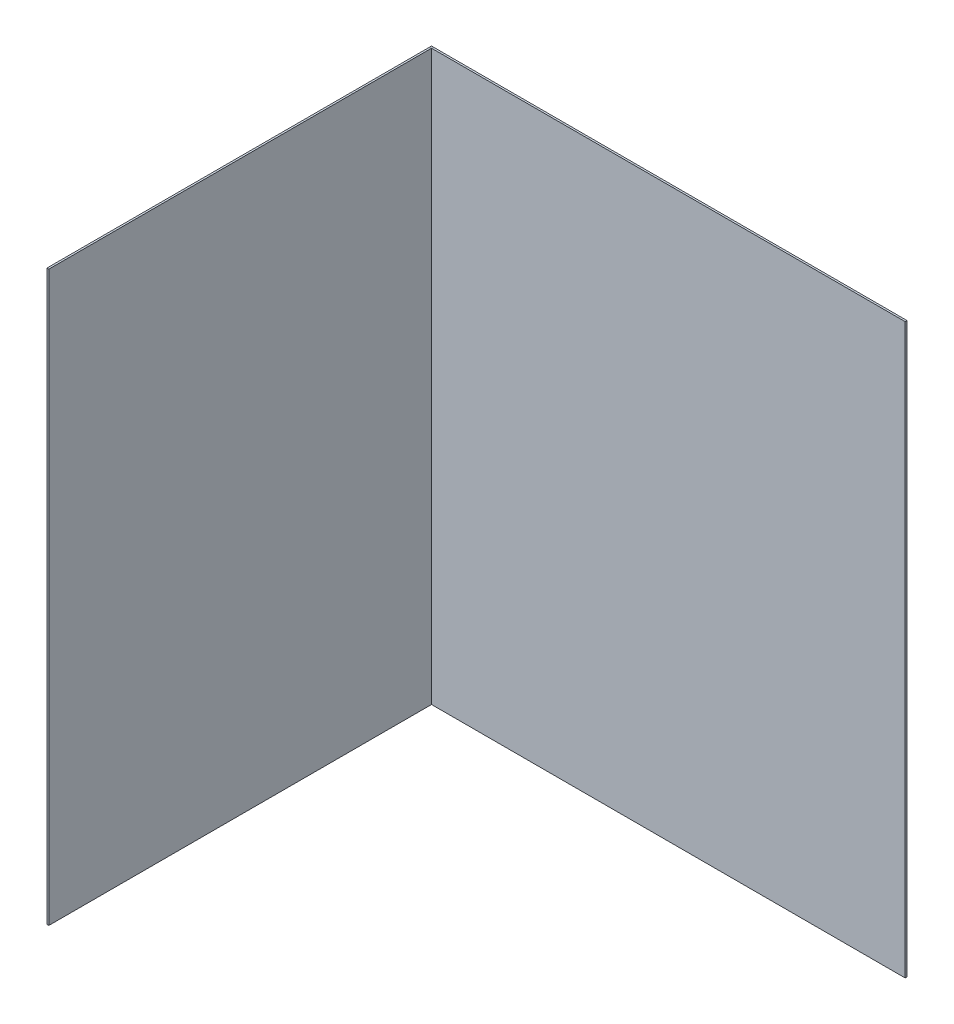
ISO-10303-21;
HEADER;
FILE_DESCRIPTION(('STEP AP214'),'2;1');
FILE_NAME('part.step','',(''),(''),'','','');
FILE_SCHEMA(('AUTOMOTIVE_DESIGN { 1 0 10303 214 1 1 1 1 }'));
ENDSEC;
DATA;
#1=APPLICATION_CONTEXT('core data for automotive mechanical design processes');
#2=APPLICATION_PROTOCOL_DEFINITION('international standard','automotive_design',2000,#1);
#3=PRODUCT_CONTEXT('',#1,'mechanical');
#4=PRODUCT('Part','Part','',(#3));
#5=PRODUCT_RELATED_PRODUCT_CATEGORY('part','',(#4));
#6=PRODUCT_DEFINITION_FORMATION('','',#4);
#7=PRODUCT_DEFINITION_CONTEXT('part definition',#1,'design');
#8=PRODUCT_DEFINITION('design','',#6,#7);
#9=PRODUCT_DEFINITION_SHAPE('','',#8);
#10=(LENGTH_UNIT() NAMED_UNIT(*) SI_UNIT(.MILLI.,.METRE.));
#11=(NAMED_UNIT(*) PLANE_ANGLE_UNIT() SI_UNIT($,.RADIAN.));
#12=(NAMED_UNIT(*) SI_UNIT($,.STERADIAN.) SOLID_ANGLE_UNIT());
#13=UNCERTAINTY_MEASURE_WITH_UNIT(LENGTH_MEASURE(1.E-05),#10,'distance_accuracy_value','');
#14=(GEOMETRIC_REPRESENTATION_CONTEXT(3) GLOBAL_UNCERTAINTY_ASSIGNED_CONTEXT((#13)) GLOBAL_UNIT_ASSIGNED_CONTEXT((#10,
#11,#12)) REPRESENTATION_CONTEXT('',''));
#15=CARTESIAN_POINT('',(0.,0.,0.));
#16=DIRECTION('',(0.,0.,1.));
#17=DIRECTION('',(1.,0.,0.));
#18=AXIS2_PLACEMENT_3D('',#15,#16,#17);
#19=CARTESIAN_POINT('',(-0.001,0.,0.));
#20=DIRECTION('',(1.,0.,0.));
#21=DIRECTION('',(0.,0.,1.));
#22=AXIS2_PLACEMENT_3D('',#19,#20,#21);
#23=PLANE('',#22);
#24=DIRECTION('',(0.,0.,1.));
#25=VECTOR('',#24,1.);
#26=CARTESIAN_POINT('',(-0.001,0.,0.));
#27=LINE('',#26,#25);
#28=CARTESIAN_POINT('',(-0.001,0.,0.001));
#29=VERTEX_POINT('',#28);
#30=CARTESIAN_POINT('',(-0.001,0.,0.203));
#31=VERTEX_POINT('',#30);
#32=EDGE_CURVE('E117',#29,#31,#27,.T.);
#33=ORIENTED_EDGE('',*,*,#32,.T.);
#34=DIRECTION('',(0.,1.,0.));
#35=VECTOR('',#34,1.);
#36=CARTESIAN_POINT('',(-0.001,0.,0.203));
#37=LINE('',#36,#35);
#38=CARTESIAN_POINT('',(-0.001,0.3,0.203));
#39=VERTEX_POINT('',#38);
#40=EDGE_CURVE('E11',#31,#39,#37,.T.);
#41=ORIENTED_EDGE('',*,*,#40,.T.);
#42=DIRECTION('',(0.,0.,-1.));
#43=VECTOR('',#42,1.);
#44=CARTESIAN_POINT('',(-0.001,0.3,0.203));
#45=LINE('',#44,#43);
#46=CARTESIAN_POINT('',(-0.001,0.3,0.001));
#47=VERTEX_POINT('',#46);
#48=EDGE_CURVE('E20',#39,#47,#45,.T.);
#49=ORIENTED_EDGE('',*,*,#48,.T.);
#50=DIRECTION('',(0.,-1.,0.));
#51=VECTOR('',#50,1.);
#52=CARTESIAN_POINT('',(-0.001,0.3,0.001));
#53=LINE('',#52,#51);
#54=EDGE_CURVE('E185',#47,#29,#53,.T.);
#55=ORIENTED_EDGE('',*,*,#54,.T.);
#56=EDGE_LOOP('',(#33,#41,#49,#55));
#57=FACE_BOUND('',#56,.T.);
#58=ADVANCED_FACE('F16',(#57),#23,.F.);
#59=CARTESIAN_POINT('',(0.,0.,0.203));
#60=DIRECTION('',(0.,0.,-1.));
#61=DIRECTION('',(0.,-1.,0.));
#62=AXIS2_PLACEMENT_3D('',#59,#60,#61);
#63=PLANE('',#62);
#64=DIRECTION('',(-1.,0.,0.));
#65=VECTOR('',#64,1.);
#66=CARTESIAN_POINT('',(0.,0.,0.203));
#67=LINE('',#66,#65);
#68=CARTESIAN_POINT('',(0.,0.,0.203));
#69=VERTEX_POINT('',#68);
#70=EDGE_CURVE('E188',#69,#31,#67,.T.);
#71=ORIENTED_EDGE('',*,*,#70,.F.);
#72=DIRECTION('',(0.,1.,0.));
#73=VECTOR('',#72,1.);
#74=CARTESIAN_POINT('',(0.,0.,0.203));
#75=LINE('',#74,#73);
#76=CARTESIAN_POINT('',(0.,0.3,0.203));
#77=VERTEX_POINT('',#76);
#78=EDGE_CURVE('E106',#69,#77,#75,.T.);
#79=ORIENTED_EDGE('',*,*,#78,.T.);
#80=DIRECTION('',(-1.,0.,0.));
#81=VECTOR('',#80,1.);
#82=CARTESIAN_POINT('',(0.,0.3,0.203));
#83=LINE('',#82,#81);
#84=EDGE_CURVE('E27',#77,#39,#83,.T.);
#85=ORIENTED_EDGE('',*,*,#84,.T.);
#86=ORIENTED_EDGE('',*,*,#40,.F.);
#87=EDGE_LOOP('',(#71,#79,#85,#86));
#88=FACE_BOUND('',#87,.T.);
#89=ADVANCED_FACE('F18',(#88),#63,.F.);
#90=CARTESIAN_POINT('',(0.,0.3,0.203));
#91=DIRECTION('',(0.,-1.,0.));
#92=DIRECTION('',(0.,0.,-1.));
#93=AXIS2_PLACEMENT_3D('',#90,#91,#92);
#94=PLANE('',#93);
#95=DIRECTION('',(0.,0.,-1.));
#96=VECTOR('',#95,1.);
#97=CARTESIAN_POINT('',(0.,0.3,0.203));
#98=LINE('',#97,#96);
#99=CARTESIAN_POINT('',(0.,0.3,0.001));
#100=VERTEX_POINT('',#99);
#101=EDGE_CURVE('E110',#77,#100,#98,.T.);
#102=ORIENTED_EDGE('',*,*,#101,.T.);
#103=DIRECTION('',(-1.,0.,0.));
#104=VECTOR('',#103,1.);
#105=CARTESIAN_POINT('',(0.25,0.3,0.001));
#106=LINE('',#105,#104);
#107=EDGE_CURVE('E181',#100,#47,#106,.T.);
#108=ORIENTED_EDGE('',*,*,#107,.T.);
#109=ORIENTED_EDGE('',*,*,#48,.F.);
#110=ORIENTED_EDGE('',*,*,#84,.F.);
#111=EDGE_LOOP('',(#102,#108,#109,#110));
#112=FACE_BOUND('',#111,.T.);
#113=ADVANCED_FACE('F216',(#112),#94,.F.);
#114=CARTESIAN_POINT('',(-0.001,0.3,0.));
#115=DIRECTION('',(1.,0.,0.));
#116=DIRECTION('',(0.,1.,0.));
#117=AXIS2_PLACEMENT_3D('',#114,#115,#116);
#118=PLANE('',#117);
#119=DIRECTION('',(0.,0.,1.));
#120=VECTOR('',#119,1.);
#121=CARTESIAN_POINT('',(-0.001,0.3,0.));
#122=LINE('',#121,#120);
#123=CARTESIAN_POINT('',(-0.001,0.3,0.));
#124=VERTEX_POINT('',#123);
#125=EDGE_CURVE('E175',#124,#47,#122,.T.);
#126=ORIENTED_EDGE('',*,*,#125,.F.);
#127=DIRECTION('',(0.,-1.,0.));
#128=VECTOR('',#127,1.);
#129=CARTESIAN_POINT('',(-0.001,0.3,0.));
#130=LINE('',#129,#128);
#131=CARTESIAN_POINT('',(-0.001,0.,0.));
#132=VERTEX_POINT('',#131);
#133=EDGE_CURVE('E111',#124,#132,#130,.T.);
#134=ORIENTED_EDGE('',*,*,#133,.T.);
#135=DIRECTION('',(0.,0.,1.));
#136=VECTOR('',#135,1.);
#137=CARTESIAN_POINT('',(-0.001,0.,0.));
#138=LINE('',#137,#136);
#139=EDGE_CURVE('E123',#132,#29,#138,.T.);
#140=ORIENTED_EDGE('',*,*,#139,.T.);
#141=ORIENTED_EDGE('',*,*,#54,.F.);
#142=EDGE_LOOP('',(#126,#134,#140,#141));
#143=FACE_BOUND('',#142,.T.);
#144=ADVANCED_FACE('F213',(#143),#118,.F.);
#145=CARTESIAN_POINT('',(0.,0.,0.));
#146=DIRECTION('',(0.,1.,0.));
#147=DIRECTION('',(1.,0.,0.));
#148=AXIS2_PLACEMENT_3D('',#145,#146,#147);
#149=PLANE('',#148);
#150=DIRECTION('',(0.,0.,1.));
#151=VECTOR('',#150,1.);
#152=CARTESIAN_POINT('',(0.,0.,0.));
#153=LINE('',#152,#151);
#154=CARTESIAN_POINT('',(0.,0.,0.001));
#155=VERTEX_POINT('',#154);
#156=EDGE_CURVE('E98',#155,#69,#153,.T.);
#157=ORIENTED_EDGE('',*,*,#156,.T.);
#158=ORIENTED_EDGE('',*,*,#70,.T.);
#159=ORIENTED_EDGE('',*,*,#32,.F.);
#160=DIRECTION('',(1.,0.,0.));
#161=VECTOR('',#160,1.);
#162=CARTESIAN_POINT('',(-0.001,0.,0.001));
#163=LINE('',#162,#161);
#164=EDGE_CURVE('E115',#29,#155,#163,.T.);
#165=ORIENTED_EDGE('',*,*,#164,.T.);
#166=EDGE_LOOP('',(#157,#158,#159,#165));
#167=FACE_BOUND('',#166,.T.);
#168=ADVANCED_FACE('F116',(#167),#149,.F.);
#169=CARTESIAN_POINT('',(0.,0.,0.));
#170=DIRECTION('',(1.,0.,0.));
#171=DIRECTION('',(0.,0.,1.));
#172=AXIS2_PLACEMENT_3D('',#169,#170,#171);
#173=PLANE('',#172);
#174=ORIENTED_EDGE('',*,*,#156,.F.);
#175=DIRECTION('',(0.,-1.,0.));
#176=VECTOR('',#175,1.);
#177=CARTESIAN_POINT('',(0.,0.,0.001));
#178=LINE('',#177,#176);
#179=EDGE_CURVE('E103',#100,#155,#178,.T.);
#180=ORIENTED_EDGE('',*,*,#179,.F.);
#181=ORIENTED_EDGE('',*,*,#101,.F.);
#182=ORIENTED_EDGE('',*,*,#78,.F.);
#183=EDGE_LOOP('',(#174,#180,#181,#182));
#184=FACE_BOUND('',#183,.T.);
#185=ADVANCED_FACE('F100',(#184),#173,.T.);
#186=CARTESIAN_POINT('',(-0.001,0.,0.));
#187=DIRECTION('',(0.,0.,-1.));
#188=DIRECTION('',(0.,-1.,0.));
#189=AXIS2_PLACEMENT_3D('',#186,#187,#188);
#190=PLANE('',#189);
#191=DIRECTION('',(0.,-1.,0.));
#192=VECTOR('',#191,1.);
#193=CARTESIAN_POINT('',(0.,0.3,0.));
#194=LINE('',#193,#192);
#195=CARTESIAN_POINT('',(0.,0.3,0.));
#196=VERTEX_POINT('',#195);
#197=CARTESIAN_POINT('',(0.,0.,0.));
#198=VERTEX_POINT('',#197);
#199=EDGE_CURVE('E134',#196,#198,#194,.T.);
#200=ORIENTED_EDGE('',*,*,#199,.T.);
#201=DIRECTION('',(-1.,0.,0.));
#202=VECTOR('',#201,1.);
#203=CARTESIAN_POINT('',(0.,0.,0.));
#204=LINE('',#203,#202);
#205=EDGE_CURVE('E140',#198,#132,#204,.T.);
#206=ORIENTED_EDGE('',*,*,#205,.T.);
#207=ORIENTED_EDGE('',*,*,#133,.F.);
#208=DIRECTION('',(-1.,0.,0.));
#209=VECTOR('',#208,1.);
#210=CARTESIAN_POINT('',(0.,0.3,0.));
#211=LINE('',#210,#209);
#212=EDGE_CURVE('E171',#196,#124,#211,.T.);
#213=ORIENTED_EDGE('',*,*,#212,.F.);
#214=EDGE_LOOP('',(#200,#206,#207,#213));
#215=FACE_BOUND('',#214,.T.);
#216=ADVANCED_FACE('F311',(#215),#190,.T.);
#217=CARTESIAN_POINT('',(0.,0.3,0.203));
#218=DIRECTION('',(0.,-1.,0.));
#219=DIRECTION('',(0.,0.,-1.));
#220=AXIS2_PLACEMENT_3D('',#217,#218,#219);
#221=PLANE('',#220);
#222=DIRECTION('',(0.,0.,-1.));
#223=VECTOR('',#222,1.);
#224=CARTESIAN_POINT('',(0.,0.3,0.203));
#225=LINE('',#224,#223);
#226=EDGE_CURVE('E165',#100,#196,#225,.T.);
#227=ORIENTED_EDGE('',*,*,#226,.T.);
#228=ORIENTED_EDGE('',*,*,#212,.T.);
#229=ORIENTED_EDGE('',*,*,#125,.T.);
#230=ORIENTED_EDGE('',*,*,#107,.F.);
#231=EDGE_LOOP('',(#227,#228,#229,#230));
#232=FACE_BOUND('',#231,.T.);
#233=ADVANCED_FACE('F210',(#232),#221,.F.);
#234=CARTESIAN_POINT('',(0.,0.,0.));
#235=DIRECTION('',(0.,1.,0.));
#236=DIRECTION('',(1.,0.,0.));
#237=AXIS2_PLACEMENT_3D('',#234,#235,#236);
#238=PLANE('',#237);
#239=DIRECTION('',(0.,0.,1.));
#240=VECTOR('',#239,1.);
#241=CARTESIAN_POINT('',(0.,0.,0.));
#242=LINE('',#241,#240);
#243=EDGE_CURVE('E137',#198,#155,#242,.T.);
#244=ORIENTED_EDGE('',*,*,#243,.T.);
#245=ORIENTED_EDGE('',*,*,#164,.F.);
#246=ORIENTED_EDGE('',*,*,#139,.F.);
#247=ORIENTED_EDGE('',*,*,#205,.F.);
#248=EDGE_LOOP('',(#244,#245,#246,#247));
#249=FACE_BOUND('',#248,.T.);
#250=ADVANCED_FACE('F138',(#249),#238,.F.);
#251=CARTESIAN_POINT('',(-0.001,0.,0.001));
#252=DIRECTION('',(0.,0.,-1.));
#253=DIRECTION('',(0.,-1.,0.));
#254=AXIS2_PLACEMENT_3D('',#251,#252,#253);
#255=PLANE('',#254);
#256=DIRECTION('',(1.,0.,0.));
#257=VECTOR('',#256,1.);
#258=CARTESIAN_POINT('',(-0.001,0.,0.001));
#259=LINE('',#258,#257);
#260=CARTESIAN_POINT('',(0.25,0.,0.001));
#261=VERTEX_POINT('',#260);
#262=EDGE_CURVE('E129',#155,#261,#259,.T.);
#263=ORIENTED_EDGE('',*,*,#262,.T.);
#264=DIRECTION('',(0.,1.,0.));
#265=VECTOR('',#264,1.);
#266=CARTESIAN_POINT('',(0.25,0.,0.001));
#267=LINE('',#266,#265);
#268=CARTESIAN_POINT('',(0.25,0.3,0.001));
#269=VERTEX_POINT('',#268);
#270=EDGE_CURVE('E158',#261,#269,#267,.T.);
#271=ORIENTED_EDGE('',*,*,#270,.T.);
#272=DIRECTION('',(-1.,0.,0.));
#273=VECTOR('',#272,1.);
#274=CARTESIAN_POINT('',(0.25,0.3,0.001));
#275=LINE('',#274,#273);
#276=EDGE_CURVE('E131',#269,#100,#275,.T.);
#277=ORIENTED_EDGE('',*,*,#276,.T.);
#278=ORIENTED_EDGE('',*,*,#179,.T.);
#279=EDGE_LOOP('',(#263,#271,#277,#278));
#280=FACE_BOUND('',#279,.T.);
#281=ADVANCED_FACE('F126',(#280),#255,.F.);
#282=CARTESIAN_POINT('',(-0.001,0.,0.));
#283=DIRECTION('',(0.,0.,-1.));
#284=DIRECTION('',(0.,-1.,0.));
#285=AXIS2_PLACEMENT_3D('',#282,#283,#284);
#286=PLANE('',#285);
#287=DIRECTION('',(1.,0.,0.));
#288=VECTOR('',#287,1.);
#289=CARTESIAN_POINT('',(-0.001,0.,0.));
#290=LINE('',#289,#288);
#291=CARTESIAN_POINT('',(0.25,0.,0.));
#292=VERTEX_POINT('',#291);
#293=EDGE_CURVE('E152',#198,#292,#290,.T.);
#294=ORIENTED_EDGE('',*,*,#293,.F.);
#295=ORIENTED_EDGE('',*,*,#199,.F.);
#296=DIRECTION('',(-1.,0.,0.));
#297=VECTOR('',#296,1.);
#298=CARTESIAN_POINT('',(0.25,0.3,0.));
#299=LINE('',#298,#297);
#300=CARTESIAN_POINT('',(0.25,0.3,0.));
#301=VERTEX_POINT('',#300);
#302=EDGE_CURVE('E145',#301,#196,#299,.T.);
#303=ORIENTED_EDGE('',*,*,#302,.F.);
#304=DIRECTION('',(0.,1.,0.));
#305=VECTOR('',#304,1.);
#306=CARTESIAN_POINT('',(0.25,0.,0.));
#307=LINE('',#306,#305);
#308=EDGE_CURVE('E178',#292,#301,#307,.T.);
#309=ORIENTED_EDGE('',*,*,#308,.F.);
#310=EDGE_LOOP('',(#294,#295,#303,#309));
#311=FACE_BOUND('',#310,.T.);
#312=ADVANCED_FACE('F242',(#311),#286,.T.);
#313=CARTESIAN_POINT('',(0.25,0.3,0.));
#314=DIRECTION('',(0.,-1.,0.));
#315=DIRECTION('',(0.,0.,-1.));
#316=AXIS2_PLACEMENT_3D('',#313,#314,#315);
#317=PLANE('',#316);
#318=ORIENTED_EDGE('',*,*,#302,.T.);
#319=ORIENTED_EDGE('',*,*,#226,.F.);
#320=ORIENTED_EDGE('',*,*,#276,.F.);
#321=DIRECTION('',(0.,0.,1.));
#322=VECTOR('',#321,1.);
#323=CARTESIAN_POINT('',(0.25,0.3,0.));
#324=LINE('',#323,#322);
#325=EDGE_CURVE('E162',#301,#269,#324,.T.);
#326=ORIENTED_EDGE('',*,*,#325,.F.);
#327=EDGE_LOOP('',(#318,#319,#320,#326));
#328=FACE_BOUND('',#327,.T.);
#329=ADVANCED_FACE('F236',(#328),#317,.F.);
#330=CARTESIAN_POINT('',(-0.001,0.,0.));
#331=DIRECTION('',(0.,1.,0.));
#332=DIRECTION('',(1.,0.,0.));
#333=AXIS2_PLACEMENT_3D('',#330,#331,#332);
#334=PLANE('',#333);
#335=ORIENTED_EDGE('',*,*,#293,.T.);
#336=DIRECTION('',(0.,0.,1.));
#337=VECTOR('',#336,1.);
#338=CARTESIAN_POINT('',(0.25,0.,0.));
#339=LINE('',#338,#337);
#340=EDGE_CURVE('E150',#292,#261,#339,.T.);
#341=ORIENTED_EDGE('',*,*,#340,.T.);
#342=ORIENTED_EDGE('',*,*,#262,.F.);
#343=ORIENTED_EDGE('',*,*,#243,.F.);
#344=EDGE_LOOP('',(#335,#341,#342,#343));
#345=FACE_BOUND('',#344,.T.);
#346=ADVANCED_FACE('F148',(#345),#334,.F.);
#347=CARTESIAN_POINT('',(0.25,0.,0.));
#348=DIRECTION('',(-1.,0.,0.));
#349=DIRECTION('',(0.,0.,1.));
#350=AXIS2_PLACEMENT_3D('',#347,#348,#349);
#351=PLANE('',#350);
#352=ORIENTED_EDGE('',*,*,#340,.F.);
#353=ORIENTED_EDGE('',*,*,#308,.T.);
#354=ORIENTED_EDGE('',*,*,#325,.T.);
#355=ORIENTED_EDGE('',*,*,#270,.F.);
#356=EDGE_LOOP('',(#352,#353,#354,#355));
#357=FACE_BOUND('',#356,.T.);
#358=ADVANCED_FACE('F233',(#357),#351,.F.);
#359=CLOSED_SHELL('',(#58,#89,#113,#144,#168,#185,#216,#233,#250,#281,#312,#329,#346,#358));
#360=MANIFOLD_SOLID_BREP('B1',#359);
#361=ADVANCED_BREP_SHAPE_REPRESENTATION('',(#18,#360),#14);
#362=SHAPE_DEFINITION_REPRESENTATION(#9,#361);
ENDSEC;
END-ISO-10303-21;
